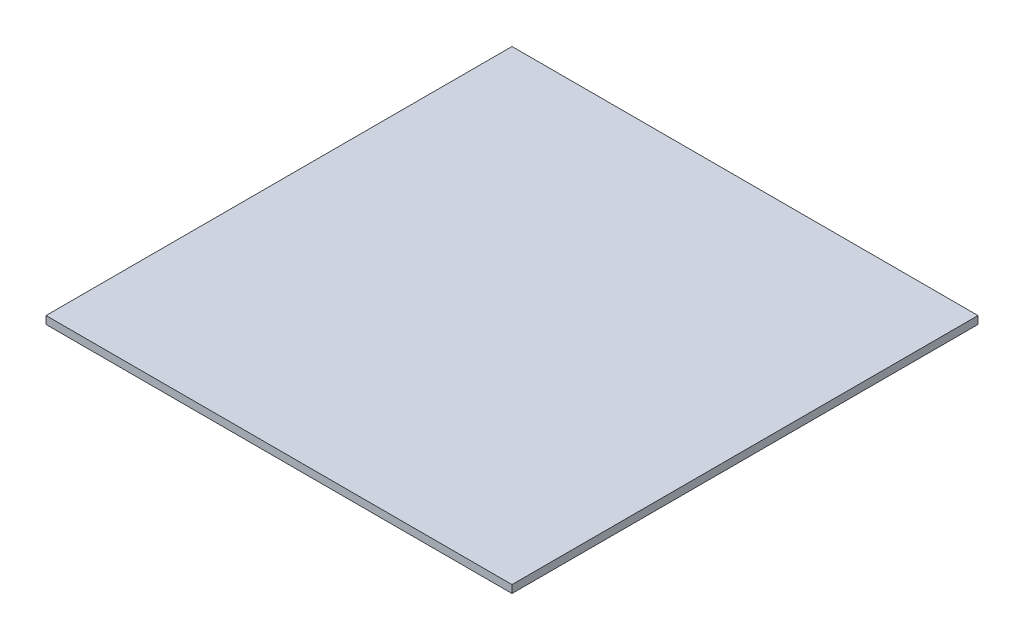
ISO-10303-21;
HEADER;
FILE_DESCRIPTION(('STEP AP214'),'2;1');
FILE_NAME('part.step','',(''),(''),'','','');
FILE_SCHEMA(('AUTOMOTIVE_DESIGN { 1 0 10303 214 1 1 1 1 }'));
ENDSEC;
DATA;
#1=APPLICATION_CONTEXT('core data for automotive mechanical design processes');
#2=APPLICATION_PROTOCOL_DEFINITION('international standard','automotive_design',2000,#1);
#3=PRODUCT_CONTEXT('',#1,'mechanical');
#4=PRODUCT('Part','Part','',(#3));
#5=PRODUCT_RELATED_PRODUCT_CATEGORY('part','',(#4));
#6=PRODUCT_DEFINITION_FORMATION('','',#4);
#7=PRODUCT_DEFINITION_CONTEXT('part definition',#1,'design');
#8=PRODUCT_DEFINITION('design','',#6,#7);
#9=PRODUCT_DEFINITION_SHAPE('','',#8);
#10=(LENGTH_UNIT() NAMED_UNIT(*) SI_UNIT(.MILLI.,.METRE.));
#11=(NAMED_UNIT(*) PLANE_ANGLE_UNIT() SI_UNIT($,.RADIAN.));
#12=(NAMED_UNIT(*) SI_UNIT($,.STERADIAN.) SOLID_ANGLE_UNIT());
#13=UNCERTAINTY_MEASURE_WITH_UNIT(LENGTH_MEASURE(1.E-05),#10,'distance_accuracy_value','');
#14=(GEOMETRIC_REPRESENTATION_CONTEXT(3) GLOBAL_UNCERTAINTY_ASSIGNED_CONTEXT((#13)) GLOBAL_UNIT_ASSIGNED_CONTEXT((#10,
#11,#12)) REPRESENTATION_CONTEXT('',''));
#15=CARTESIAN_POINT('',(0.,0.,0.));
#16=DIRECTION('',(0.,0.,1.));
#17=DIRECTION('',(1.,0.,0.));
#18=AXIS2_PLACEMENT_3D('',#15,#16,#17);
#19=CARTESIAN_POINT('',(-150.,5.,-150.));
#20=DIRECTION('',(1.,0.,0.));
#21=DIRECTION('',(0.,0.,-1.));
#22=AXIS2_PLACEMENT_3D('',#19,#20,#21);
#23=PLANE('',#22);
#24=DIRECTION('',(0.,0.,1.));
#25=VECTOR('',#24,1.);
#26=CARTESIAN_POINT('',(-150.,0.,-150.));
#27=LINE('',#26,#25);
#28=CARTESIAN_POINT('',(-150.,0.,-150.));
#29=VERTEX_POINT('',#28);
#30=CARTESIAN_POINT('',(-150.,0.,150.));
#31=VERTEX_POINT('',#30);
#32=EDGE_CURVE('E104',#29,#31,#27,.T.);
#33=ORIENTED_EDGE('',*,*,#32,.T.);
#34=DIRECTION('',(0.,-1.,0.));
#35=VECTOR('',#34,1.);
#36=CARTESIAN_POINT('',(-150.,5.,150.));
#37=LINE('',#36,#35);
#38=CARTESIAN_POINT('',(-150.,5.,150.));
#39=VERTEX_POINT('',#38);
#40=EDGE_CURVE('E11',#39,#31,#37,.T.);
#41=ORIENTED_EDGE('',*,*,#40,.F.);
#42=DIRECTION('',(0.,0.,1.));
#43=VECTOR('',#42,1.);
#44=CARTESIAN_POINT('',(-150.,5.,-150.));
#45=LINE('',#44,#43);
#46=CARTESIAN_POINT('',(-150.,5.,-150.));
#47=VERTEX_POINT('',#46);
#48=EDGE_CURVE('E92',#47,#39,#45,.T.);
#49=ORIENTED_EDGE('',*,*,#48,.F.);
#50=DIRECTION('',(0.,-1.,0.));
#51=VECTOR('',#50,1.);
#52=CARTESIAN_POINT('',(-150.,5.,-150.));
#53=LINE('',#52,#51);
#54=EDGE_CURVE('E100',#47,#29,#53,.T.);
#55=ORIENTED_EDGE('',*,*,#54,.T.);
#56=EDGE_LOOP('',(#33,#41,#49,#55));
#57=FACE_BOUND('',#56,.T.);
#58=ADVANCED_FACE('F41',(#57),#23,.F.);
#59=CARTESIAN_POINT('',(-150.,5.,150.));
#60=DIRECTION('',(0.,0.,-1.));
#61=DIRECTION('',(-1.,0.,0.));
#62=AXIS2_PLACEMENT_3D('',#59,#60,#61);
#63=PLANE('',#62);
#64=DIRECTION('',(1.,0.,0.));
#65=VECTOR('',#64,1.);
#66=CARTESIAN_POINT('',(-150.,0.,150.));
#67=LINE('',#66,#65);
#68=CARTESIAN_POINT('',(150.,0.,150.));
#69=VERTEX_POINT('',#68);
#70=EDGE_CURVE('E96',#31,#69,#67,.T.);
#71=ORIENTED_EDGE('',*,*,#70,.T.);
#72=DIRECTION('',(0.,-1.,0.));
#73=VECTOR('',#72,1.);
#74=CARTESIAN_POINT('',(150.,5.,150.));
#75=LINE('',#74,#73);
#76=CARTESIAN_POINT('',(150.,5.,150.));
#77=VERTEX_POINT('',#76);
#78=EDGE_CURVE('E49',#77,#69,#75,.T.);
#79=ORIENTED_EDGE('',*,*,#78,.F.);
#80=DIRECTION('',(1.,0.,0.));
#81=VECTOR('',#80,1.);
#82=CARTESIAN_POINT('',(-150.,5.,150.));
#83=LINE('',#82,#81);
#84=EDGE_CURVE('E87',#39,#77,#83,.T.);
#85=ORIENTED_EDGE('',*,*,#84,.F.);
#86=ORIENTED_EDGE('',*,*,#40,.T.);
#87=EDGE_LOOP('',(#71,#79,#85,#86));
#88=FACE_BOUND('',#87,.T.);
#89=ADVANCED_FACE('F95',(#88),#63,.F.);
#90=CARTESIAN_POINT('',(150.,5.,-150.));
#91=DIRECTION('',(-1.,0.,0.));
#92=DIRECTION('',(0.,0.,1.));
#93=AXIS2_PLACEMENT_3D('',#90,#91,#92);
#94=PLANE('',#93);
#95=DIRECTION('',(0.,0.,-1.));
#96=VECTOR('',#95,1.);
#97=CARTESIAN_POINT('',(150.,0.,-150.));
#98=LINE('',#97,#96);
#99=CARTESIAN_POINT('',(150.,0.,-150.));
#100=VERTEX_POINT('',#99);
#101=EDGE_CURVE('E74',#69,#100,#98,.T.);
#102=ORIENTED_EDGE('',*,*,#101,.T.);
#103=DIRECTION('',(0.,-1.,0.));
#104=VECTOR('',#103,1.);
#105=CARTESIAN_POINT('',(150.,5.,-150.));
#106=LINE('',#105,#104);
#107=CARTESIAN_POINT('',(150.,5.,-150.));
#108=VERTEX_POINT('',#107);
#109=EDGE_CURVE('E97',#108,#100,#106,.T.);
#110=ORIENTED_EDGE('',*,*,#109,.F.);
#111=DIRECTION('',(0.,0.,-1.));
#112=VECTOR('',#111,1.);
#113=CARTESIAN_POINT('',(150.,5.,-150.));
#114=LINE('',#113,#112);
#115=EDGE_CURVE('E90',#77,#108,#114,.T.);
#116=ORIENTED_EDGE('',*,*,#115,.F.);
#117=ORIENTED_EDGE('',*,*,#78,.T.);
#118=EDGE_LOOP('',(#102,#110,#116,#117));
#119=FACE_BOUND('',#118,.T.);
#120=ADVANCED_FACE('F98',(#119),#94,.F.);
#121=CARTESIAN_POINT('',(-150.,5.,-150.));
#122=DIRECTION('',(0.,0.,1.));
#123=DIRECTION('',(1.,0.,0.));
#124=AXIS2_PLACEMENT_3D('',#121,#122,#123);
#125=PLANE('',#124);
#126=DIRECTION('',(-1.,0.,0.));
#127=VECTOR('',#126,1.);
#128=CARTESIAN_POINT('',(-150.,0.,-150.));
#129=LINE('',#128,#127);
#130=EDGE_CURVE('E80',#100,#29,#129,.T.);
#131=ORIENTED_EDGE('',*,*,#130,.T.);
#132=ORIENTED_EDGE('',*,*,#54,.F.);
#133=DIRECTION('',(-1.,0.,0.));
#134=VECTOR('',#133,1.);
#135=CARTESIAN_POINT('',(-150.,5.,-150.));
#136=LINE('',#135,#134);
#137=EDGE_CURVE('E57',#108,#47,#136,.T.);
#138=ORIENTED_EDGE('',*,*,#137,.F.);
#139=ORIENTED_EDGE('',*,*,#109,.T.);
#140=EDGE_LOOP('',(#131,#132,#138,#139));
#141=FACE_BOUND('',#140,.T.);
#142=ADVANCED_FACE('F111',(#141),#125,.F.);
#143=CARTESIAN_POINT('',(0.,5.,0.));
#144=DIRECTION('',(0.,1.,0.));
#145=DIRECTION('',(0.,0.,1.));
#146=AXIS2_PLACEMENT_3D('',#143,#144,#145);
#147=PLANE('',#146);
#148=ORIENTED_EDGE('',*,*,#48,.T.);
#149=ORIENTED_EDGE('',*,*,#84,.T.);
#150=ORIENTED_EDGE('',*,*,#115,.T.);
#151=ORIENTED_EDGE('',*,*,#137,.T.);
#152=EDGE_LOOP('',(#148,#149,#150,#151));
#153=FACE_BOUND('',#152,.T.);
#154=ADVANCED_FACE('F88',(#153),#147,.T.);
#155=CARTESIAN_POINT('',(0.,0.,0.));
#156=DIRECTION('',(0.,1.,0.));
#157=DIRECTION('',(0.,0.,1.));
#158=AXIS2_PLACEMENT_3D('',#155,#156,#157);
#159=PLANE('',#158);
#160=ORIENTED_EDGE('',*,*,#32,.F.);
#161=ORIENTED_EDGE('',*,*,#130,.F.);
#162=ORIENTED_EDGE('',*,*,#101,.F.);
#163=ORIENTED_EDGE('',*,*,#70,.F.);
#164=EDGE_LOOP('',(#160,#161,#162,#163));
#165=FACE_BOUND('',#164,.T.);
#166=ADVANCED_FACE('F114',(#165),#159,.F.);
#167=CLOSED_SHELL('',(#58,#89,#120,#142,#154,#166));
#168=MANIFOLD_SOLID_BREP('B2',#167);
#169=ADVANCED_BREP_SHAPE_REPRESENTATION('',(#18,#168),#14);
#170=SHAPE_DEFINITION_REPRESENTATION(#9,#169);
ENDSEC;
END-ISO-10303-21;
